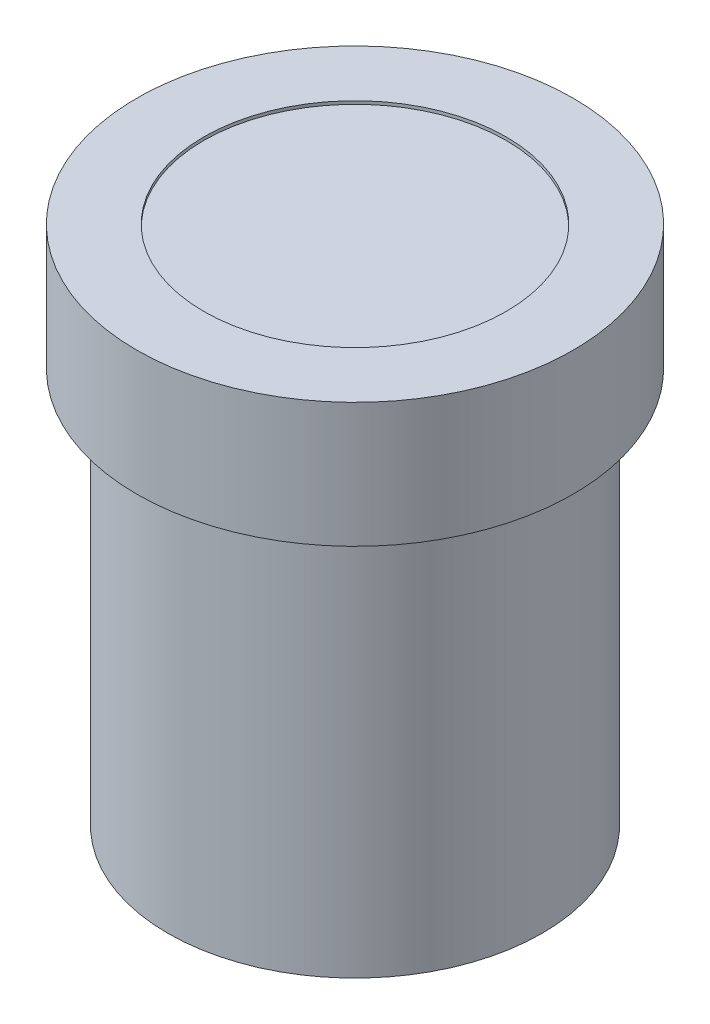
ISO-10303-21;
HEADER;
FILE_DESCRIPTION(('STEP AP214'),'2;1');
FILE_NAME('part.step','',(''),(''),'','','');
FILE_SCHEMA(('AUTOMOTIVE_DESIGN { 1 0 10303 214 1 1 1 1 }'));
ENDSEC;
DATA;
#1=APPLICATION_CONTEXT('core data for automotive mechanical design processes');
#2=APPLICATION_PROTOCOL_DEFINITION('international standard','automotive_design',2000,#1);
#3=PRODUCT_CONTEXT('',#1,'mechanical');
#4=PRODUCT('Part','Part','',(#3));
#5=PRODUCT_RELATED_PRODUCT_CATEGORY('part','',(#4));
#6=PRODUCT_DEFINITION_FORMATION('','',#4);
#7=PRODUCT_DEFINITION_CONTEXT('part definition',#1,'design');
#8=PRODUCT_DEFINITION('design','',#6,#7);
#9=PRODUCT_DEFINITION_SHAPE('','',#8);
#10=(LENGTH_UNIT() NAMED_UNIT(*) SI_UNIT(.MILLI.,.METRE.));
#11=(NAMED_UNIT(*) PLANE_ANGLE_UNIT() SI_UNIT($,.RADIAN.));
#12=(NAMED_UNIT(*) SI_UNIT($,.STERADIAN.) SOLID_ANGLE_UNIT());
#13=UNCERTAINTY_MEASURE_WITH_UNIT(LENGTH_MEASURE(1.E-05),#10,'distance_accuracy_value','');
#14=(GEOMETRIC_REPRESENTATION_CONTEXT(3) GLOBAL_UNCERTAINTY_ASSIGNED_CONTEXT((#13)) GLOBAL_UNIT_ASSIGNED_CONTEXT((#10,
#11,#12)) REPRESENTATION_CONTEXT('',''));
#15=CARTESIAN_POINT('',(0.,0.,0.));
#16=DIRECTION('',(0.,0.,1.));
#17=DIRECTION('',(1.,0.,0.));
#18=AXIS2_PLACEMENT_3D('',#15,#16,#17);
#19=CARTESIAN_POINT('',(0.,12.6,0.));
#20=DIRECTION('',(0.,1.,0.));
#21=DIRECTION('',(0.,0.,1.));
#22=AXIS2_PLACEMENT_3D('',#19,#20,#21);
#23=CYLINDRICAL_SURFACE('',#22,2.25);
#24=CARTESIAN_POINT('',(0.,12.6,0.));
#25=DIRECTION('',(0.,1.,0.));
#26=DIRECTION('',(0.,0.,1.));
#27=AXIS2_PLACEMENT_3D('',#24,#25,#26);
#28=CIRCLE('',#27,2.25);
#29=CARTESIAN_POINT('',(0.,12.6,2.25));
#30=VERTEX_POINT('',#29);
#31=EDGE_CURVE('E11',#30,#30,#28,.F.);
#32=ORIENTED_EDGE('',*,*,#31,.F.);
#33=EDGE_LOOP('',(#32));
#34=FACE_BOUND('',#33,.T.);
#35=CARTESIAN_POINT('',(0.,12.7,0.));
#36=DIRECTION('',(0.,1.,0.));
#37=DIRECTION('',(0.,0.,1.));
#38=AXIS2_PLACEMENT_3D('',#35,#36,#37);
#39=CIRCLE('',#38,2.25);
#40=CARTESIAN_POINT('',(0.,12.7,2.25));
#41=VERTEX_POINT('',#40);
#42=EDGE_CURVE('E50',#41,#41,#39,.F.);
#43=ORIENTED_EDGE('',*,*,#42,.T.);
#44=EDGE_LOOP('',(#43));
#45=FACE_BOUND('',#44,.T.);
#46=ADVANCED_FACE('F46',(#34,#45),#23,.T.);
#47=CARTESIAN_POINT('',(0.,12.6,0.));
#48=DIRECTION('',(0.,1.,0.));
#49=DIRECTION('',(0.,0.,1.));
#50=AXIS2_PLACEMENT_3D('',#47,#48,#49);
#51=PLANE('',#50);
#52=ORIENTED_EDGE('',*,*,#31,.T.);
#53=EDGE_LOOP('',(#52));
#54=FACE_BOUND('',#53,.T.);
#55=ADVANCED_FACE('F61',(#54),#51,.F.);
#56=CARTESIAN_POINT('',(0.,12.434375,0.));
#57=DIRECTION('',(0.,0.,1.));
#58=DIRECTION('',(1.,0.,0.));
#59=AXIS2_PLACEMENT_3D('',#56,#57,#58);
#60=SPHERICAL_SURFACE('',#59,2.265625);
#61=CARTESIAN_POINT('',(0.,12.434375,0.));
#62=DIRECTION('',(0.,1.,0.));
#63=DIRECTION('',(0.,0.,1.));
#64=AXIS2_PLACEMENT_3D('',#61,#62,#63);
#65=SPHERICAL_SURFACE('',#64,2.265625);
#66=ORIENTED_EDGE('',*,*,#42,.F.);
#67=EDGE_LOOP('',(#66));
#68=FACE_BOUND('',#67,.T.);
#69=ADVANCED_FACE('F48',(#68),#65,.T.);
#70=CLOSED_SHELL('',(#46,#55,#69));
#71=MANIFOLD_SOLID_BREP('B2',#70);
#72=CARTESIAN_POINT('',(0.,16.7,0.));
#73=DIRECTION('',(0.,-1.,0.));
#74=DIRECTION('',(0.,0.,-1.));
#75=AXIS2_PLACEMENT_3D('',#72,#73,#74);
#76=CYLINDRICAL_SURFACE('',#75,4.85);
#77=CARTESIAN_POINT('',(0.,12.7,0.));
#78=DIRECTION('',(0.,1.,0.));
#79=DIRECTION('',(0.,0.,1.));
#80=AXIS2_PLACEMENT_3D('',#77,#78,#79);
#81=CIRCLE('',#80,4.85);
#82=CARTESIAN_POINT('',(0.,12.7,4.85));
#83=VERTEX_POINT('',#82);
#84=EDGE_CURVE('E98',#83,#83,#81,.F.);
#85=ORIENTED_EDGE('',*,*,#84,.T.);
#86=EDGE_LOOP('',(#85));
#87=FACE_BOUND('',#86,.T.);
#88=CARTESIAN_POINT('',(0.,16.5,0.));
#89=DIRECTION('',(0.,1.,0.));
#90=DIRECTION('',(0.,0.,1.));
#91=AXIS2_PLACEMENT_3D('',#88,#89,#90);
#92=CIRCLE('',#91,4.85);
#93=CARTESIAN_POINT('',(0.,16.5,4.85));
#94=VERTEX_POINT('',#93);
#95=EDGE_CURVE('E122',#94,#94,#92,.T.);
#96=ORIENTED_EDGE('',*,*,#95,.T.);
#97=EDGE_LOOP('',(#96));
#98=FACE_BOUND('',#97,.T.);
#99=ADVANCED_FACE('F91',(#87,#98),#76,.F.);
#100=CARTESIAN_POINT('',(0.,12.7,0.));
#101=DIRECTION('',(0.,1.,0.));
#102=DIRECTION('',(0.,0.,1.));
#103=AXIS2_PLACEMENT_3D('',#100,#101,#102);
#104=PLANE('',#103);
#105=CARTESIAN_POINT('',(0.,12.7,0.));
#106=DIRECTION('',(0.,1.,0.));
#107=DIRECTION('',(0.,0.,1.));
#108=AXIS2_PLACEMENT_3D('',#105,#106,#107);
#109=CIRCLE('',#108,2.25);
#110=CARTESIAN_POINT('',(0.,12.7,2.25));
#111=VERTEX_POINT('',#110);
#112=EDGE_CURVE('E110',#111,#111,#109,.T.);
#113=ORIENTED_EDGE('',*,*,#112,.F.);
#114=EDGE_LOOP('',(#113));
#115=FACE_BOUND('',#114,.T.);
#116=ORIENTED_EDGE('',*,*,#84,.F.);
#117=EDGE_LOOP('',(#116));
#118=FACE_BOUND('',#117,.T.);
#119=ADVANCED_FACE('F141',(#115,#118),#104,.T.);
#120=CARTESIAN_POINT('',(0.,0.,0.));
#121=DIRECTION('',(0.,1.,0.));
#122=DIRECTION('',(0.,0.,1.));
#123=AXIS2_PLACEMENT_3D('',#120,#121,#122);
#124=PLANE('',#123);
#125=CARTESIAN_POINT('',(0.,0.,0.));
#126=DIRECTION('',(0.,1.,0.));
#127=DIRECTION('',(0.,0.,1.));
#128=AXIS2_PLACEMENT_3D('',#125,#126,#127);
#129=CIRCLE('',#128,6.);
#130=CARTESIAN_POINT('',(0.,0.,6.));
#131=VERTEX_POINT('',#130);
#132=EDGE_CURVE('E106',#131,#131,#129,.T.);
#133=ORIENTED_EDGE('',*,*,#132,.F.);
#134=EDGE_LOOP('',(#133));
#135=FACE_BOUND('',#134,.T.);
#136=CARTESIAN_POINT('',(0.,0.,0.));
#137=DIRECTION('',(0.,1.,0.));
#138=DIRECTION('',(0.,0.,1.));
#139=AXIS2_PLACEMENT_3D('',#136,#137,#138);
#140=CIRCLE('',#139,2.25);
#141=CARTESIAN_POINT('',(0.,0.,2.25));
#142=VERTEX_POINT('',#141);
#143=EDGE_CURVE('E112',#142,#142,#140,.T.);
#144=ORIENTED_EDGE('',*,*,#143,.T.);
#145=EDGE_LOOP('',(#144));
#146=FACE_BOUND('',#145,.T.);
#147=ADVANCED_FACE('F147',(#135,#146),#124,.F.);
#148=CARTESIAN_POINT('',(0.,12.7,0.));
#149=DIRECTION('',(0.,-1.,0.));
#150=DIRECTION('',(0.,0.,-1.));
#151=AXIS2_PLACEMENT_3D('',#148,#149,#150);
#152=CYLINDRICAL_SURFACE('',#151,6.);
#153=CARTESIAN_POINT('',(0.,12.7,0.));
#154=DIRECTION('',(0.,1.,0.));
#155=DIRECTION('',(0.,0.,1.));
#156=AXIS2_PLACEMENT_3D('',#153,#154,#155);
#157=CIRCLE('',#156,6.);
#158=CARTESIAN_POINT('',(0.,12.7,6.));
#159=VERTEX_POINT('',#158);
#160=EDGE_CURVE('E102',#159,#159,#157,.T.);
#161=ORIENTED_EDGE('',*,*,#160,.F.);
#162=EDGE_LOOP('',(#161));
#163=FACE_BOUND('',#162,.T.);
#164=ORIENTED_EDGE('',*,*,#132,.T.);
#165=EDGE_LOOP('',(#164));
#166=FACE_BOUND('',#165,.T.);
#167=ADVANCED_FACE('F93',(#163,#166),#152,.T.);
#168=CARTESIAN_POINT('',(0.,12.7,0.));
#169=DIRECTION('',(0.,-1.,0.));
#170=DIRECTION('',(0.,0.,-1.));
#171=AXIS2_PLACEMENT_3D('',#168,#169,#170);
#172=CYLINDRICAL_SURFACE('',#171,2.25);
#173=ORIENTED_EDGE('',*,*,#112,.T.);
#174=EDGE_LOOP('',(#173));
#175=FACE_BOUND('',#174,.T.);
#176=ORIENTED_EDGE('',*,*,#143,.F.);
#177=EDGE_LOOP('',(#176));
#178=FACE_BOUND('',#177,.T.);
#179=ADVANCED_FACE('F162',(#175,#178),#172,.F.);
#180=CARTESIAN_POINT('',(0.,16.7,0.));
#181=DIRECTION('',(0.,-1.,0.));
#182=DIRECTION('',(0.,0.,-1.));
#183=AXIS2_PLACEMENT_3D('',#180,#181,#182);
#184=CYLINDRICAL_SURFACE('',#183,7.);
#185=CARTESIAN_POINT('',(0.,16.7,0.));
#186=DIRECTION('',(0.,1.,0.));
#187=DIRECTION('',(0.,0.,1.));
#188=AXIS2_PLACEMENT_3D('',#185,#186,#187);
#189=CIRCLE('',#188,7.);
#190=CARTESIAN_POINT('',(0.,16.7,7.));
#191=VERTEX_POINT('',#190);
#192=EDGE_CURVE('E121',#191,#191,#189,.T.);
#193=ORIENTED_EDGE('',*,*,#192,.F.);
#194=EDGE_LOOP('',(#193));
#195=FACE_BOUND('',#194,.T.);
#196=CARTESIAN_POINT('',(0.,12.7,0.));
#197=DIRECTION('',(0.,1.,0.));
#198=DIRECTION('',(0.,0.,1.));
#199=AXIS2_PLACEMENT_3D('',#196,#197,#198);
#200=CIRCLE('',#199,7.);
#201=CARTESIAN_POINT('',(0.,12.7,7.));
#202=VERTEX_POINT('',#201);
#203=EDGE_CURVE('E118',#202,#202,#200,.T.);
#204=ORIENTED_EDGE('',*,*,#203,.T.);
#205=EDGE_LOOP('',(#204));
#206=FACE_BOUND('',#205,.T.);
#207=ADVANCED_FACE('F154',(#195,#206),#184,.T.);
#208=CARTESIAN_POINT('',(0.,16.6,0.));
#209=DIRECTION('',(0.,1.,0.));
#210=DIRECTION('',(0.,0.,1.));
#211=AXIS2_PLACEMENT_3D('',#208,#209,#210);
#212=CIRCLE('',#211,4.85);
#213=CARTESIAN_POINT('',(0.,16.6,4.85));
#214=VERTEX_POINT('',#213);
#215=EDGE_CURVE('E45',#214,#214,#212,.T.);
#216=ORIENTED_EDGE('',*,*,#215,.F.);
#217=EDGE_LOOP('',(#216));
#218=FACE_BOUND('',#217,.T.);
#219=CARTESIAN_POINT('',(0.,16.7,0.));
#220=DIRECTION('',(0.,1.,0.));
#221=DIRECTION('',(0.,0.,1.));
#222=AXIS2_PLACEMENT_3D('',#219,#220,#221);
#223=CIRCLE('',#222,4.85);
#224=CARTESIAN_POINT('',(0.,16.7,4.85));
#225=VERTEX_POINT('',#224);
#226=EDGE_CURVE('E115',#225,#225,#223,.T.);
#227=ORIENTED_EDGE('',*,*,#226,.T.);
#228=EDGE_LOOP('',(#227));
#229=FACE_BOUND('',#228,.T.);
#230=ADVANCED_FACE('F143',(#218,#229),#76,.F.);
#231=CARTESIAN_POINT('',(0.,16.7,0.));
#232=DIRECTION('',(0.,1.,0.));
#233=DIRECTION('',(0.,0.,1.));
#234=AXIS2_PLACEMENT_3D('',#231,#232,#233);
#235=PLANE('',#234);
#236=ORIENTED_EDGE('',*,*,#192,.T.);
#237=EDGE_LOOP('',(#236));
#238=FACE_BOUND('',#237,.T.);
#239=ORIENTED_EDGE('',*,*,#226,.F.);
#240=EDGE_LOOP('',(#239));
#241=FACE_BOUND('',#240,.T.);
#242=ADVANCED_FACE('F153',(#238,#241),#235,.T.);
#243=CARTESIAN_POINT('',(0.,12.7,0.));
#244=DIRECTION('',(0.,1.,0.));
#245=DIRECTION('',(0.,0.,1.));
#246=AXIS2_PLACEMENT_3D('',#243,#244,#245);
#247=PLANE('',#246);
#248=ORIENTED_EDGE('',*,*,#160,.T.);
#249=EDGE_LOOP('',(#248));
#250=FACE_BOUND('',#249,.T.);
#251=ORIENTED_EDGE('',*,*,#203,.F.);
#252=EDGE_LOOP('',(#251));
#253=FACE_BOUND('',#252,.T.);
#254=ADVANCED_FACE('F138',(#250,#253),#247,.F.);
#255=CARTESIAN_POINT('',(0.,16.6,0.));
#256=DIRECTION('',(0.,1.,0.));
#257=DIRECTION('',(0.,0.,1.));
#258=AXIS2_PLACEMENT_3D('',#255,#256,#257);
#259=PLANE('',#258);
#260=ORIENTED_EDGE('',*,*,#215,.T.);
#261=EDGE_LOOP('',(#260));
#262=FACE_BOUND('',#261,.T.);
#263=ADVANCED_FACE('F133',(#262),#259,.T.);
#264=CARTESIAN_POINT('',(0.,16.5,0.));
#265=DIRECTION('',(0.,1.,0.));
#266=DIRECTION('',(0.,0.,1.));
#267=AXIS2_PLACEMENT_3D('',#264,#265,#266);
#268=PLANE('',#267);
#269=ORIENTED_EDGE('',*,*,#95,.F.);
#270=EDGE_LOOP('',(#269));
#271=FACE_BOUND('',#270,.T.);
#272=ADVANCED_FACE('F131',(#271),#268,.F.);
#273=CLOSED_SHELL('',(#99,#119,#147,#167,#179,#207,#230,#242,#254,#263,#272));
#274=MANIFOLD_SOLID_BREP('B6',#273);
#275=ADVANCED_BREP_SHAPE_REPRESENTATION('',(#18,#71,#274),#14);
#276=SHAPE_DEFINITION_REPRESENTATION(#9,#275);
ENDSEC;
END-ISO-10303-21;
